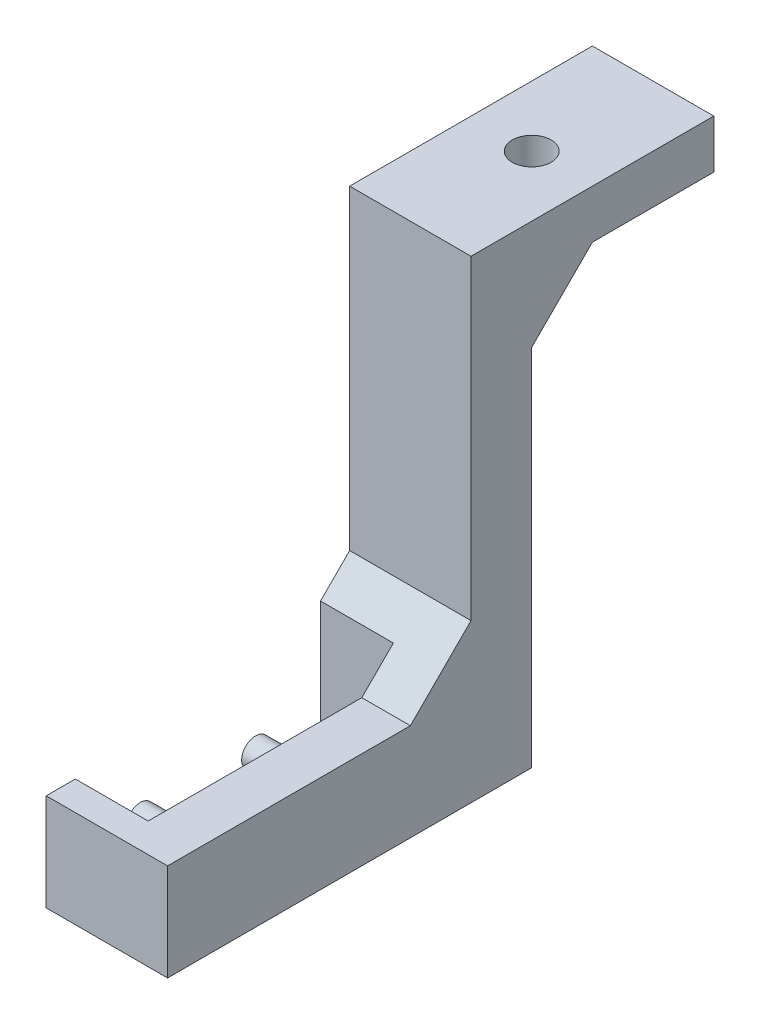
ISO-10303-21;
HEADER;
FILE_DESCRIPTION(('STEP AP214'),'2;1');
FILE_NAME('part.step','',(''),(''),'','','');
FILE_SCHEMA(('AUTOMOTIVE_DESIGN { 1 0 10303 214 1 1 1 1 }'));
ENDSEC;
DATA;
#1=APPLICATION_CONTEXT('core data for automotive mechanical design processes');
#2=APPLICATION_PROTOCOL_DEFINITION('international standard','automotive_design',2000,#1);
#3=PRODUCT_CONTEXT('',#1,'mechanical');
#4=PRODUCT('Part','Part','',(#3));
#5=PRODUCT_RELATED_PRODUCT_CATEGORY('part','',(#4));
#6=PRODUCT_DEFINITION_FORMATION('','',#4);
#7=PRODUCT_DEFINITION_CONTEXT('part definition',#1,'design');
#8=PRODUCT_DEFINITION('design','',#6,#7);
#9=PRODUCT_DEFINITION_SHAPE('','',#8);
#10=(LENGTH_UNIT() NAMED_UNIT(*) SI_UNIT(.MILLI.,.METRE.));
#11=(NAMED_UNIT(*) PLANE_ANGLE_UNIT() SI_UNIT($,.RADIAN.));
#12=(NAMED_UNIT(*) SI_UNIT($,.STERADIAN.) SOLID_ANGLE_UNIT());
#13=UNCERTAINTY_MEASURE_WITH_UNIT(LENGTH_MEASURE(1.E-05),#10,'distance_accuracy_value','');
#14=(GEOMETRIC_REPRESENTATION_CONTEXT(3) GLOBAL_UNCERTAINTY_ASSIGNED_CONTEXT((#13)) GLOBAL_UNIT_ASSIGNED_CONTEXT((#10,
#11,#12)) REPRESENTATION_CONTEXT('',''));
#15=CARTESIAN_POINT('',(0.,0.,0.));
#16=DIRECTION('',(0.,0.,1.));
#17=DIRECTION('',(1.,0.,0.));
#18=AXIS2_PLACEMENT_3D('',#15,#16,#17);
#19=CARTESIAN_POINT('',(5.,35.,-35.));
#20=DIRECTION('',(0.,-0.707106781186551,-0.707106781186544));
#21=DIRECTION('',(1.,0.,0.));
#22=AXIS2_PLACEMENT_3D('',#19,#20,#21);
#23=PLANE('',#22);
#24=CARTESIAN_POINT('',(0.,35.,-35.));
#25=DIRECTION('',(0.,-0.707106781186551,-0.707106781186544));
#26=DIRECTION('',(0.,0.707106781186544,-0.707106781186551));
#27=AXIS2_PLACEMENT_3D('',#24,#25,#26);
#28=ELLIPSE('',#27,4.24264068711927,3.);
#29=CARTESIAN_POINT('',(3.,35.,-35.));
#30=VERTEX_POINT('',#29);
#31=CARTESIAN_POINT('',(-3.,35.,-35.));
#32=VERTEX_POINT('',#31);
#33=EDGE_CURVE('E11',#30,#32,#28,.T.);
#34=ORIENTED_EDGE('',*,*,#33,.F.);
#35=DIRECTION('',(-1.,0.,0.));
#36=VECTOR('',#35,1.);
#37=CARTESIAN_POINT('',(-5.,35.,-35.));
#38=LINE('',#37,#36);
#39=CARTESIAN_POINT('',(5.,35.,-35.));
#40=VERTEX_POINT('',#39);
#41=EDGE_CURVE('E157',#40,#30,#38,.T.);
#42=ORIENTED_EDGE('',*,*,#41,.F.);
#43=DIRECTION('',(0.,-0.707106781186544,0.707106781186551));
#44=VECTOR('',#43,1.);
#45=CARTESIAN_POINT('',(5.,35.,-35.));
#46=LINE('',#45,#44);
#47=CARTESIAN_POINT('',(5.,30.,-30.));
#48=VERTEX_POINT('',#47);
#49=EDGE_CURVE('E184',#48,#40,#46,.F.);
#50=ORIENTED_EDGE('',*,*,#49,.F.);
#51=DIRECTION('',(1.,0.,0.));
#52=VECTOR('',#51,1.);
#53=CARTESIAN_POINT('',(5.,30.,-30.));
#54=LINE('',#53,#52);
#55=CARTESIAN_POINT('',(-5.,30.,-30.));
#56=VERTEX_POINT('',#55);
#57=EDGE_CURVE('E165',#56,#48,#54,.T.);
#58=ORIENTED_EDGE('',*,*,#57,.F.);
#59=DIRECTION('',(0.,0.707106781186544,-0.707106781186551));
#60=VECTOR('',#59,1.);
#61=CARTESIAN_POINT('',(-5.,0.,0.));
#62=LINE('',#61,#60);
#63=CARTESIAN_POINT('',(-5.,35.,-35.));
#64=VERTEX_POINT('',#63);
#65=EDGE_CURVE('E181',#64,#56,#62,.F.);
#66=ORIENTED_EDGE('',*,*,#65,.F.);
#67=EDGE_CURVE('E159',#32,#64,#38,.T.);
#68=ORIENTED_EDGE('',*,*,#67,.F.);
#69=EDGE_LOOP('',(#34,#42,#50,#58,#66,#68));
#70=FACE_BOUND('',#69,.T.);
#71=ADVANCED_FACE('F41',(#70),#23,.T.);
#72=CARTESIAN_POINT('',(-5.,0.,0.));
#73=DIRECTION('',(1.,0.,0.));
#74=DIRECTION('',(0.,0.,-1.));
#75=AXIS2_PLACEMENT_3D('',#72,#73,#74);
#76=PLANE('',#75);
#77=DIRECTION('',(0.,0.,-1.));
#78=VECTOR('',#77,1.);
#79=CARTESIAN_POINT('',(-5.,0.,0.));
#80=LINE('',#79,#78);
#81=CARTESIAN_POINT('',(-5.,0.,-22.6));
#82=VERTEX_POINT('',#81);
#83=CARTESIAN_POINT('',(-5.,0.,-30.));
#84=VERTEX_POINT('',#83);
#85=EDGE_CURVE('E279',#82,#84,#80,.T.);
#86=ORIENTED_EDGE('',*,*,#85,.F.);
#87=DIRECTION('',(0.,-1.,0.));
#88=VECTOR('',#87,1.);
#89=CARTESIAN_POINT('',(-5.,8.,-22.6));
#90=LINE('',#89,#88);
#91=CARTESIAN_POINT('',(-5.,10.6000000000001,-22.6));
#92=VERTEX_POINT('',#91);
#93=EDGE_CURVE('E65',#92,#82,#90,.T.);
#94=ORIENTED_EDGE('',*,*,#93,.F.);
#95=DIRECTION('',(0.,-0.707106781186544,0.707106781186551));
#96=VECTOR('',#95,1.);
#97=CARTESIAN_POINT('',(-5.,-5.99999999999992,-5.99999999999986));
#98=LINE('',#97,#96);
#99=CARTESIAN_POINT('',(-5.,13.,-25.));
#100=VERTEX_POINT('',#99);
#101=EDGE_CURVE('E194',#92,#100,#98,.F.);
#102=ORIENTED_EDGE('',*,*,#101,.T.);
#103=DIRECTION('',(0.,-1.,0.));
#104=VECTOR('',#103,1.);
#105=CARTESIAN_POINT('',(-5.,39.,-25.));
#106=LINE('',#105,#104);
#107=CARTESIAN_POINT('',(-5.,39.,-25.));
#108=VERTEX_POINT('',#107);
#109=EDGE_CURVE('E297',#108,#100,#106,.T.);
#110=ORIENTED_EDGE('',*,*,#109,.F.);
#111=DIRECTION('',(0.,0.,1.));
#112=VECTOR('',#111,1.);
#113=CARTESIAN_POINT('',(-5.,39.,-45.));
#114=LINE('',#113,#112);
#115=CARTESIAN_POINT('',(-5.,39.,-45.));
#116=VERTEX_POINT('',#115);
#117=EDGE_CURVE('E294',#116,#108,#114,.T.);
#118=ORIENTED_EDGE('',*,*,#117,.F.);
#119=DIRECTION('',(0.,1.,0.));
#120=VECTOR('',#119,1.);
#121=CARTESIAN_POINT('',(-5.,35.,-45.));
#122=LINE('',#121,#120);
#123=CARTESIAN_POINT('',(-5.,35.,-45.));
#124=VERTEX_POINT('',#123);
#125=EDGE_CURVE('E291',#124,#116,#122,.T.);
#126=ORIENTED_EDGE('',*,*,#125,.F.);
#127=DIRECTION('',(0.,0.,-1.));
#128=VECTOR('',#127,1.);
#129=CARTESIAN_POINT('',(-5.,35.,-30.));
#130=LINE('',#129,#128);
#131=EDGE_CURVE('E288',#64,#124,#130,.T.);
#132=ORIENTED_EDGE('',*,*,#131,.F.);
#133=ORIENTED_EDGE('',*,*,#65,.T.);
#134=DIRECTION('',(0.,1.,0.));
#135=VECTOR('',#134,1.);
#136=CARTESIAN_POINT('',(-5.,0.,-30.));
#137=LINE('',#136,#135);
#138=EDGE_CURVE('E284',#84,#56,#137,.T.);
#139=ORIENTED_EDGE('',*,*,#138,.F.);
#140=EDGE_LOOP('',(#86,#94,#102,#110,#118,#126,#132,#133,#139));
#141=FACE_BOUND('',#140,.T.);
#142=ADVANCED_FACE('F385',(#141),#76,.F.);
#143=CARTESIAN_POINT('',(5.,8.,0.));
#144=DIRECTION('',(0.,0.,-1.));
#145=DIRECTION('',(0.,1.,0.));
#146=AXIS2_PLACEMENT_3D('',#143,#144,#145);
#147=PLANE('',#146);
#148=DIRECTION('',(0.,-1.,0.));
#149=VECTOR('',#148,1.);
#150=CARTESIAN_POINT('',(-5.,8.,0.));
#151=LINE('',#150,#149);
#152=CARTESIAN_POINT('',(-5.,8.,0.));
#153=VERTEX_POINT('',#152);
#154=CARTESIAN_POINT('',(-5.,0.,0.));
#155=VERTEX_POINT('',#154);
#156=EDGE_CURVE('E252',#153,#155,#151,.T.);
#157=ORIENTED_EDGE('',*,*,#156,.T.);
#158=DIRECTION('',(-1.,0.,0.));
#159=VECTOR('',#158,1.);
#160=CARTESIAN_POINT('',(5.,0.,0.));
#161=LINE('',#160,#159);
#162=CARTESIAN_POINT('',(5.,0.,0.));
#163=VERTEX_POINT('',#162);
#164=EDGE_CURVE('E171',#163,#155,#161,.T.);
#165=ORIENTED_EDGE('',*,*,#164,.F.);
#166=DIRECTION('',(0.,-1.,0.));
#167=VECTOR('',#166,1.);
#168=CARTESIAN_POINT('',(5.,8.,0.));
#169=LINE('',#168,#167);
#170=CARTESIAN_POINT('',(5.,8.,0.));
#171=VERTEX_POINT('',#170);
#172=EDGE_CURVE('E255',#171,#163,#169,.T.);
#173=ORIENTED_EDGE('',*,*,#172,.F.);
#174=DIRECTION('',(-1.,0.,0.));
#175=VECTOR('',#174,1.);
#176=CARTESIAN_POINT('',(5.,8.,0.));
#177=LINE('',#176,#175);
#178=EDGE_CURVE('E215',#171,#153,#177,.T.);
#179=ORIENTED_EDGE('',*,*,#178,.T.);
#180=EDGE_LOOP('',(#157,#165,#173,#179));
#181=FACE_BOUND('',#180,.T.);
#182=ADVANCED_FACE('F331',(#181),#147,.F.);
#183=CARTESIAN_POINT('',(5.,0.,0.));
#184=DIRECTION('',(0.,1.,0.));
#185=DIRECTION('',(0.,0.,1.));
#186=AXIS2_PLACEMENT_3D('',#183,#184,#185);
#187=PLANE('',#186);
#188=DIRECTION('',(0.,0.,1.));
#189=VECTOR('',#188,1.);
#190=CARTESIAN_POINT('',(1.,0.,-22.6));
#191=LINE('',#190,#189);
#192=CARTESIAN_POINT('',(1.,0.,-22.6));
#193=VERTEX_POINT('',#192);
#194=CARTESIAN_POINT('',(1.,0.,-2.4));
#195=VERTEX_POINT('',#194);
#196=EDGE_CURVE('E239',#193,#195,#191,.T.);
#197=ORIENTED_EDGE('',*,*,#196,.F.);
#198=DIRECTION('',(-1.,0.,0.));
#199=VECTOR('',#198,1.);
#200=CARTESIAN_POINT('',(1.,0.,-22.6));
#201=LINE('',#200,#199);
#202=EDGE_CURVE('E232',#193,#82,#201,.T.);
#203=ORIENTED_EDGE('',*,*,#202,.T.);
#204=ORIENTED_EDGE('',*,*,#85,.T.);
#205=DIRECTION('',(-1.,0.,0.));
#206=VECTOR('',#205,1.);
#207=CARTESIAN_POINT('',(5.,0.,-30.));
#208=LINE('',#207,#206);
#209=CARTESIAN_POINT('',(5.,0.,-30.));
#210=VERTEX_POINT('',#209);
#211=EDGE_CURVE('E316',#210,#84,#208,.T.);
#212=ORIENTED_EDGE('',*,*,#211,.F.);
#213=DIRECTION('',(0.,0.,-1.));
#214=VECTOR('',#213,1.);
#215=CARTESIAN_POINT('',(5.,0.,0.));
#216=LINE('',#215,#214);
#217=EDGE_CURVE('E258',#163,#210,#216,.T.);
#218=ORIENTED_EDGE('',*,*,#217,.F.);
#219=ORIENTED_EDGE('',*,*,#164,.T.);
#220=CARTESIAN_POINT('',(-5.,0.,-2.4));
#221=VERTEX_POINT('',#220);
#222=EDGE_CURVE('E280',#155,#221,#80,.T.);
#223=ORIENTED_EDGE('',*,*,#222,.T.);
#224=DIRECTION('',(-1.,0.,0.));
#225=VECTOR('',#224,1.);
#226=CARTESIAN_POINT('',(1.,0.,-2.4));
#227=LINE('',#226,#225);
#228=EDGE_CURVE('E237',#195,#221,#227,.T.);
#229=ORIENTED_EDGE('',*,*,#228,.F.);
#230=EDGE_LOOP('',(#197,#203,#204,#212,#218,#219,#223,#229));
#231=FACE_BOUND('',#230,.T.);
#232=ADVANCED_FACE('F327',(#231),#187,.F.);
#233=CARTESIAN_POINT('',(5.,0.,-30.));
#234=DIRECTION('',(0.,0.,1.));
#235=DIRECTION('',(1.,0.,0.));
#236=AXIS2_PLACEMENT_3D('',#233,#234,#235);
#237=PLANE('',#236);
#238=ORIENTED_EDGE('',*,*,#138,.T.);
#239=ORIENTED_EDGE('',*,*,#57,.T.);
#240=DIRECTION('',(0.,1.,0.));
#241=VECTOR('',#240,1.);
#242=CARTESIAN_POINT('',(5.,0.,-30.));
#243=LINE('',#242,#241);
#244=EDGE_CURVE('E262',#210,#48,#243,.T.);
#245=ORIENTED_EDGE('',*,*,#244,.F.);
#246=ORIENTED_EDGE('',*,*,#211,.T.);
#247=EDGE_LOOP('',(#238,#239,#245,#246));
#248=FACE_BOUND('',#247,.T.);
#249=ADVANCED_FACE('F375',(#248),#237,.F.);
#250=CARTESIAN_POINT('',(5.,35.,-30.));
#251=DIRECTION('',(0.,1.,0.));
#252=DIRECTION('',(0.,0.,1.));
#253=AXIS2_PLACEMENT_3D('',#250,#251,#252);
#254=PLANE('',#253);
#255=CARTESIAN_POINT('',(0.,35.,-35.));
#256=DIRECTION('',(0.,-1.,0.));
#257=DIRECTION('',(0.,0.,-1.));
#258=AXIS2_PLACEMENT_3D('',#255,#256,#257);
#259=CIRCLE('',#258,1.6);
#260=CARTESIAN_POINT('',(0.,35.,-36.6));
#261=VERTEX_POINT('',#260);
#262=EDGE_CURVE('E356',#261,#261,#259,.T.);
#263=ORIENTED_EDGE('',*,*,#262,.F.);
#264=EDGE_LOOP('',(#263));
#265=FACE_BOUND('',#264,.T.);
#266=ORIENTED_EDGE('',*,*,#41,.T.);
#267=CARTESIAN_POINT('',(0.,35.,-35.));
#268=DIRECTION('',(0.,-1.,0.));
#269=DIRECTION('',(0.,0.,-1.));
#270=AXIS2_PLACEMENT_3D('',#267,#268,#269);
#271=CIRCLE('',#270,3.);
#272=EDGE_CURVE('E58',#30,#32,#271,.T.);
#273=ORIENTED_EDGE('',*,*,#272,.T.);
#274=ORIENTED_EDGE('',*,*,#67,.T.);
#275=ORIENTED_EDGE('',*,*,#131,.T.);
#276=DIRECTION('',(-1.,0.,0.));
#277=VECTOR('',#276,1.);
#278=CARTESIAN_POINT('',(5.,35.,-45.));
#279=LINE('',#278,#277);
#280=CARTESIAN_POINT('',(5.,35.,-45.));
#281=VERTEX_POINT('',#280);
#282=EDGE_CURVE('E313',#281,#124,#279,.T.);
#283=ORIENTED_EDGE('',*,*,#282,.F.);
#284=DIRECTION('',(0.,0.,-1.));
#285=VECTOR('',#284,1.);
#286=CARTESIAN_POINT('',(5.,35.,-30.));
#287=LINE('',#286,#285);
#288=EDGE_CURVE('E163',#40,#281,#287,.T.);
#289=ORIENTED_EDGE('',*,*,#288,.F.);
#290=EDGE_LOOP('',(#266,#273,#274,#275,#283,#289));
#291=FACE_BOUND('',#290,.T.);
#292=ADVANCED_FACE('F161',(#265,#291),#254,.F.);
#293=CARTESIAN_POINT('',(5.,35.,-45.));
#294=DIRECTION('',(0.,0.,1.));
#295=DIRECTION('',(1.,0.,0.));
#296=AXIS2_PLACEMENT_3D('',#293,#294,#295);
#297=PLANE('',#296);
#298=ORIENTED_EDGE('',*,*,#125,.T.);
#299=DIRECTION('',(-1.,0.,0.));
#300=VECTOR('',#299,1.);
#301=CARTESIAN_POINT('',(5.,39.,-45.));
#302=LINE('',#301,#300);
#303=CARTESIAN_POINT('',(5.,39.,-45.));
#304=VERTEX_POINT('',#303);
#305=EDGE_CURVE('E309',#304,#116,#302,.T.);
#306=ORIENTED_EDGE('',*,*,#305,.F.);
#307=DIRECTION('',(0.,1.,0.));
#308=VECTOR('',#307,1.);
#309=CARTESIAN_POINT('',(5.,35.,-45.));
#310=LINE('',#309,#308);
#311=EDGE_CURVE('E268',#281,#304,#310,.T.);
#312=ORIENTED_EDGE('',*,*,#311,.F.);
#313=ORIENTED_EDGE('',*,*,#282,.T.);
#314=EDGE_LOOP('',(#298,#306,#312,#313));
#315=FACE_BOUND('',#314,.T.);
#316=ADVANCED_FACE('F374',(#315),#297,.F.);
#317=CARTESIAN_POINT('',(5.,39.,-45.));
#318=DIRECTION('',(0.,-1.,0.));
#319=DIRECTION('',(0.,0.,-1.));
#320=AXIS2_PLACEMENT_3D('',#317,#318,#319);
#321=PLANE('',#320);
#322=CARTESIAN_POINT('',(0.,39.,-35.));
#323=DIRECTION('',(0.,-1.,0.));
#324=DIRECTION('',(0.,0.,-1.));
#325=AXIS2_PLACEMENT_3D('',#322,#323,#324);
#326=CIRCLE('',#325,1.6);
#327=CARTESIAN_POINT('',(0.,39.,-36.6));
#328=VERTEX_POINT('',#327);
#329=EDGE_CURVE('E152',#328,#328,#326,.T.);
#330=ORIENTED_EDGE('',*,*,#329,.T.);
#331=EDGE_LOOP('',(#330));
#332=FACE_BOUND('',#331,.T.);
#333=ORIENTED_EDGE('',*,*,#117,.T.);
#334=DIRECTION('',(-1.,0.,0.));
#335=VECTOR('',#334,1.);
#336=CARTESIAN_POINT('',(5.,39.,-25.));
#337=LINE('',#336,#335);
#338=CARTESIAN_POINT('',(5.,39.,-25.));
#339=VERTEX_POINT('',#338);
#340=EDGE_CURVE('E305',#339,#108,#337,.T.);
#341=ORIENTED_EDGE('',*,*,#340,.F.);
#342=DIRECTION('',(0.,0.,1.));
#343=VECTOR('',#342,1.);
#344=CARTESIAN_POINT('',(5.,39.,-45.));
#345=LINE('',#344,#343);
#346=EDGE_CURVE('E271',#304,#339,#345,.T.);
#347=ORIENTED_EDGE('',*,*,#346,.F.);
#348=ORIENTED_EDGE('',*,*,#305,.T.);
#349=EDGE_LOOP('',(#333,#341,#347,#348));
#350=FACE_BOUND('',#349,.T.);
#351=ADVANCED_FACE('F364',(#332,#350),#321,.F.);
#352=CARTESIAN_POINT('',(5.,39.,-25.));
#353=DIRECTION('',(0.,0.,-1.));
#354=DIRECTION('',(-1.,0.,0.));
#355=AXIS2_PLACEMENT_3D('',#352,#353,#354);
#356=PLANE('',#355);
#357=ORIENTED_EDGE('',*,*,#109,.T.);
#358=DIRECTION('',(1.,0.,0.));
#359=VECTOR('',#358,1.);
#360=CARTESIAN_POINT('',(5.,13.,-25.));
#361=LINE('',#360,#359);
#362=CARTESIAN_POINT('',(5.,13.,-25.));
#363=VERTEX_POINT('',#362);
#364=EDGE_CURVE('E178',#100,#363,#361,.T.);
#365=ORIENTED_EDGE('',*,*,#364,.T.);
#366=DIRECTION('',(0.,-1.,0.));
#367=VECTOR('',#366,1.);
#368=CARTESIAN_POINT('',(5.,39.,-25.));
#369=LINE('',#368,#367);
#370=EDGE_CURVE('E206',#339,#363,#369,.T.);
#371=ORIENTED_EDGE('',*,*,#370,.F.);
#372=ORIENTED_EDGE('',*,*,#340,.T.);
#373=EDGE_LOOP('',(#357,#365,#371,#372));
#374=FACE_BOUND('',#373,.T.);
#375=ADVANCED_FACE('F417',(#374),#356,.F.);
#376=CARTESIAN_POINT('',(5.,8.,-25.));
#377=DIRECTION('',(0.,-1.,0.));
#378=DIRECTION('',(0.,0.,-1.));
#379=AXIS2_PLACEMENT_3D('',#376,#377,#378);
#380=PLANE('',#379);
#381=DIRECTION('',(0.,0.,1.));
#382=VECTOR('',#381,1.);
#383=CARTESIAN_POINT('',(5.,8.,-25.));
#384=LINE('',#383,#382);
#385=CARTESIAN_POINT('',(5.,8.,-19.9999999999999));
#386=VERTEX_POINT('',#385);
#387=EDGE_CURVE('E203',#386,#171,#384,.T.);
#388=ORIENTED_EDGE('',*,*,#387,.F.);
#389=DIRECTION('',(-1.,0.,0.));
#390=VECTOR('',#389,1.);
#391=CARTESIAN_POINT('',(-5.,8.,-19.9999999999999));
#392=LINE('',#391,#390);
#393=CARTESIAN_POINT('',(1.,8.,-19.9999999999999));
#394=VERTEX_POINT('',#393);
#395=EDGE_CURVE('E169',#386,#394,#392,.T.);
#396=ORIENTED_EDGE('',*,*,#395,.T.);
#397=DIRECTION('',(0.,0.,-1.));
#398=VECTOR('',#397,1.);
#399=CARTESIAN_POINT('',(1.,8.,-22.6));
#400=LINE('',#399,#398);
#401=CARTESIAN_POINT('',(1.,8.,-2.4));
#402=VERTEX_POINT('',#401);
#403=EDGE_CURVE('E228',#402,#394,#400,.T.);
#404=ORIENTED_EDGE('',*,*,#403,.F.);
#405=DIRECTION('',(-1.,0.,0.));
#406=VECTOR('',#405,1.);
#407=CARTESIAN_POINT('',(1.,8.,-2.4));
#408=LINE('',#407,#406);
#409=CARTESIAN_POINT('',(-5.,8.,-2.4));
#410=VERTEX_POINT('',#409);
#411=EDGE_CURVE('E249',#402,#410,#408,.T.);
#412=ORIENTED_EDGE('',*,*,#411,.T.);
#413=DIRECTION('',(0.,0.,1.));
#414=VECTOR('',#413,1.);
#415=CARTESIAN_POINT('',(-5.,8.,-25.));
#416=LINE('',#415,#414);
#417=EDGE_CURVE('E259',#410,#153,#416,.T.);
#418=ORIENTED_EDGE('',*,*,#417,.T.);
#419=ORIENTED_EDGE('',*,*,#178,.F.);
#420=EDGE_LOOP('',(#388,#396,#404,#412,#418,#419));
#421=FACE_BOUND('',#420,.T.);
#422=ADVANCED_FACE('F211',(#421),#380,.F.);
#423=CARTESIAN_POINT('',(5.,0.,0.));
#424=DIRECTION('',(1.,0.,0.));
#425=DIRECTION('',(0.,0.,-1.));
#426=AXIS2_PLACEMENT_3D('',#423,#424,#425);
#427=PLANE('',#426);
#428=ORIENTED_EDGE('',*,*,#172,.T.);
#429=ORIENTED_EDGE('',*,*,#217,.T.);
#430=ORIENTED_EDGE('',*,*,#244,.T.);
#431=ORIENTED_EDGE('',*,*,#49,.T.);
#432=ORIENTED_EDGE('',*,*,#288,.T.);
#433=ORIENTED_EDGE('',*,*,#311,.T.);
#434=ORIENTED_EDGE('',*,*,#346,.T.);
#435=ORIENTED_EDGE('',*,*,#370,.T.);
#436=DIRECTION('',(0.,0.707106781186544,-0.707106781186551));
#437=VECTOR('',#436,1.);
#438=CARTESIAN_POINT('',(5.,8.,-19.9999999999999));
#439=LINE('',#438,#437);
#440=EDGE_CURVE('E51',#363,#386,#439,.F.);
#441=ORIENTED_EDGE('',*,*,#440,.T.);
#442=ORIENTED_EDGE('',*,*,#387,.T.);
#443=EDGE_LOOP('',(#428,#429,#430,#431,#432,#433,#434,#435,#441,#442));
#444=FACE_BOUND('',#443,.T.);
#445=ADVANCED_FACE('F202',(#444),#427,.T.);
#446=ORIENTED_EDGE('',*,*,#417,.F.);
#447=DIRECTION('',(0.,1.,0.));
#448=VECTOR('',#447,1.);
#449=CARTESIAN_POINT('',(-5.,8.,-2.4));
#450=LINE('',#449,#448);
#451=EDGE_CURVE('E245',#221,#410,#450,.T.);
#452=ORIENTED_EDGE('',*,*,#451,.F.);
#453=ORIENTED_EDGE('',*,*,#222,.F.);
#454=ORIENTED_EDGE('',*,*,#156,.F.);
#455=EDGE_LOOP('',(#446,#452,#453,#454));
#456=FACE_BOUND('',#455,.T.);
#457=ADVANCED_FACE('F334',(#456),#76,.F.);
#458=CARTESIAN_POINT('',(1.,8.,-22.6));
#459=DIRECTION('',(0.,0.,-1.));
#460=DIRECTION('',(-1.,0.,0.));
#461=AXIS2_PLACEMENT_3D('',#458,#459,#460);
#462=PLANE('',#461);
#463=ORIENTED_EDGE('',*,*,#93,.T.);
#464=ORIENTED_EDGE('',*,*,#202,.F.);
#465=DIRECTION('',(0.,-1.,0.));
#466=VECTOR('',#465,1.);
#467=CARTESIAN_POINT('',(1.,8.,-22.6));
#468=LINE('',#467,#466);
#469=CARTESIAN_POINT('',(1.,10.6000000000001,-22.6));
#470=VERTEX_POINT('',#469);
#471=EDGE_CURVE('E225',#470,#193,#468,.T.);
#472=ORIENTED_EDGE('',*,*,#471,.F.);
#473=DIRECTION('',(1.,0.,0.));
#474=VECTOR('',#473,1.);
#475=CARTESIAN_POINT('',(1.,10.6000000000001,-22.6));
#476=LINE('',#475,#474);
#477=EDGE_CURVE('E191',#470,#92,#476,.F.);
#478=ORIENTED_EDGE('',*,*,#477,.T.);
#479=EDGE_LOOP('',(#463,#464,#472,#478));
#480=FACE_BOUND('',#479,.T.);
#481=ADVANCED_FACE('F447',(#480),#462,.F.);
#482=CARTESIAN_POINT('',(1.,8.,-2.4));
#483=DIRECTION('',(0.,0.,1.));
#484=DIRECTION('',(0.,-1.,0.));
#485=AXIS2_PLACEMENT_3D('',#482,#483,#484);
#486=PLANE('',#485);
#487=ORIENTED_EDGE('',*,*,#451,.T.);
#488=ORIENTED_EDGE('',*,*,#411,.F.);
#489=DIRECTION('',(0.,1.,0.));
#490=VECTOR('',#489,1.);
#491=CARTESIAN_POINT('',(1.,8.,-2.4));
#492=LINE('',#491,#490);
#493=EDGE_CURVE('E229',#195,#402,#492,.T.);
#494=ORIENTED_EDGE('',*,*,#493,.F.);
#495=ORIENTED_EDGE('',*,*,#228,.T.);
#496=EDGE_LOOP('',(#487,#488,#494,#495));
#497=FACE_BOUND('',#496,.T.);
#498=ADVANCED_FACE('F337',(#497),#486,.F.);
#499=CARTESIAN_POINT('',(1.,0.,0.));
#500=DIRECTION('',(-1.,0.,0.));
#501=DIRECTION('',(0.,0.,1.));
#502=AXIS2_PLACEMENT_3D('',#499,#500,#501);
#503=PLANE('',#502);
#504=CARTESIAN_POINT('',(1.,2.5,-7.75));
#505=DIRECTION('',(-1.,0.,0.));
#506=DIRECTION('',(0.,0.,1.));
#507=AXIS2_PLACEMENT_3D('',#504,#505,#506);
#508=CIRCLE('',#507,1.15);
#509=CARTESIAN_POINT('',(1.,2.5,-6.6));
#510=VERTEX_POINT('',#509);
#511=EDGE_CURVE('E151',#510,#510,#508,.T.);
#512=ORIENTED_EDGE('',*,*,#511,.F.);
#513=EDGE_LOOP('',(#512));
#514=FACE_BOUND('',#513,.T.);
#515=CARTESIAN_POINT('',(1.,2.5,-17.25));
#516=DIRECTION('',(-1.,0.,0.));
#517=DIRECTION('',(0.,0.,1.));
#518=AXIS2_PLACEMENT_3D('',#515,#516,#517);
#519=CIRCLE('',#518,1.15);
#520=CARTESIAN_POINT('',(1.,2.5,-16.1));
#521=VERTEX_POINT('',#520);
#522=EDGE_CURVE('E342',#521,#521,#519,.T.);
#523=ORIENTED_EDGE('',*,*,#522,.F.);
#524=EDGE_LOOP('',(#523));
#525=FACE_BOUND('',#524,.T.);
#526=ORIENTED_EDGE('',*,*,#471,.T.);
#527=ORIENTED_EDGE('',*,*,#196,.T.);
#528=ORIENTED_EDGE('',*,*,#493,.T.);
#529=ORIENTED_EDGE('',*,*,#403,.T.);
#530=DIRECTION('',(0.,-0.707106781186544,0.707106781186551));
#531=VECTOR('',#530,1.);
#532=CARTESIAN_POINT('',(1.,8.,-19.9999999999999));
#533=LINE('',#532,#531);
#534=EDGE_CURVE('E187',#394,#470,#533,.F.);
#535=ORIENTED_EDGE('',*,*,#534,.T.);
#536=EDGE_LOOP('',(#526,#527,#528,#529,#535));
#537=FACE_BOUND('',#536,.T.);
#538=ADVANCED_FACE('F223',(#514,#525,#537),#503,.T.);
#539=CARTESIAN_POINT('',(-5.,2.5,-17.25));
#540=DIRECTION('',(1.,0.,0.));
#541=DIRECTION('',(0.,0.,-1.));
#542=AXIS2_PLACEMENT_3D('',#539,#540,#541);
#543=CYLINDRICAL_SURFACE('',#542,1.15);
#544=CARTESIAN_POINT('',(-5.,2.5,-17.25));
#545=DIRECTION('',(-1.,0.,0.));
#546=DIRECTION('',(0.,0.,1.));
#547=AXIS2_PLACEMENT_3D('',#544,#545,#546);
#548=CIRCLE('',#547,1.15);
#549=CARTESIAN_POINT('',(-5.,2.5,-16.1));
#550=VERTEX_POINT('',#549);
#551=EDGE_CURVE('E246',#550,#550,#548,.T.);
#552=ORIENTED_EDGE('',*,*,#551,.F.);
#553=EDGE_LOOP('',(#552));
#554=FACE_BOUND('',#553,.T.);
#555=ORIENTED_EDGE('',*,*,#522,.T.);
#556=EDGE_LOOP('',(#555));
#557=FACE_BOUND('',#556,.T.);
#558=ADVANCED_FACE('F463',(#554,#557),#543,.T.);
#559=CARTESIAN_POINT('',(-5.,2.5,-17.25));
#560=DIRECTION('',(-1.,0.,0.));
#561=DIRECTION('',(0.,0.,1.));
#562=AXIS2_PLACEMENT_3D('',#559,#560,#561);
#563=PLANE('',#562);
#564=ORIENTED_EDGE('',*,*,#551,.T.);
#565=EDGE_LOOP('',(#564));
#566=FACE_BOUND('',#565,.T.);
#567=ADVANCED_FACE('F524',(#566),#563,.T.);
#568=CARTESIAN_POINT('',(-5.,2.5,-7.75));
#569=DIRECTION('',(1.,0.,0.));
#570=DIRECTION('',(0.,0.,-1.));
#571=AXIS2_PLACEMENT_3D('',#568,#569,#570);
#572=CYLINDRICAL_SURFACE('',#571,1.15);
#573=CARTESIAN_POINT('',(-5.,2.5,-7.75));
#574=DIRECTION('',(-1.,0.,0.));
#575=DIRECTION('',(0.,0.,1.));
#576=AXIS2_PLACEMENT_3D('',#573,#574,#575);
#577=CIRCLE('',#576,1.15);
#578=CARTESIAN_POINT('',(-5.,2.5,-6.6));
#579=VERTEX_POINT('',#578);
#580=EDGE_CURVE('E346',#579,#579,#577,.T.);
#581=ORIENTED_EDGE('',*,*,#580,.F.);
#582=EDGE_LOOP('',(#581));
#583=FACE_BOUND('',#582,.T.);
#584=ORIENTED_EDGE('',*,*,#511,.T.);
#585=EDGE_LOOP('',(#584));
#586=FACE_BOUND('',#585,.T.);
#587=ADVANCED_FACE('F528',(#583,#586),#572,.T.);
#588=CARTESIAN_POINT('',(-5.,2.5,-7.75));
#589=DIRECTION('',(-1.,0.,0.));
#590=DIRECTION('',(0.,0.,1.));
#591=AXIS2_PLACEMENT_3D('',#588,#589,#590);
#592=PLANE('',#591);
#593=ORIENTED_EDGE('',*,*,#580,.T.);
#594=EDGE_LOOP('',(#593));
#595=FACE_BOUND('',#594,.T.);
#596=ADVANCED_FACE('F474',(#595),#592,.T.);
#597=CARTESIAN_POINT('',(5.,8.,-19.9999999999999));
#598=DIRECTION('',(0.,0.707106781186551,0.707106781186544));
#599=DIRECTION('',(1.,0.,0.));
#600=AXIS2_PLACEMENT_3D('',#597,#598,#599);
#601=PLANE('',#600);
#602=ORIENTED_EDGE('',*,*,#440,.F.);
#603=ORIENTED_EDGE('',*,*,#364,.F.);
#604=ORIENTED_EDGE('',*,*,#101,.F.);
#605=ORIENTED_EDGE('',*,*,#477,.F.);
#606=ORIENTED_EDGE('',*,*,#534,.F.);
#607=ORIENTED_EDGE('',*,*,#395,.F.);
#608=EDGE_LOOP('',(#602,#603,#604,#605,#606,#607));
#609=FACE_BOUND('',#608,.T.);
#610=ADVANCED_FACE('F44',(#609),#601,.T.);
#611=CARTESIAN_POINT('',(0.,29.,-35.));
#612=DIRECTION('',(0.,1.,0.));
#613=DIRECTION('',(0.,0.,1.));
#614=AXIS2_PLACEMENT_3D('',#611,#612,#613);
#615=CYLINDRICAL_SURFACE('',#614,3.);
#616=ORIENTED_EDGE('',*,*,#33,.T.);
#617=ORIENTED_EDGE('',*,*,#272,.F.);
#618=EDGE_LOOP('',(#616,#617));
#619=FACE_BOUND('',#618,.T.);
#620=ADVANCED_FACE('F148',(#619),#615,.F.);
#621=CARTESIAN_POINT('',(0.,39.,-35.));
#622=DIRECTION('',(0.,-1.,0.));
#623=DIRECTION('',(0.,0.,-1.));
#624=AXIS2_PLACEMENT_3D('',#621,#622,#623);
#625=CYLINDRICAL_SURFACE('',#624,1.6);
#626=ORIENTED_EDGE('',*,*,#329,.F.);
#627=EDGE_LOOP('',(#626));
#628=FACE_BOUND('',#627,.T.);
#629=ORIENTED_EDGE('',*,*,#262,.T.);
#630=EDGE_LOOP('',(#629));
#631=FACE_BOUND('',#630,.T.);
#632=ADVANCED_FACE('F367',(#628,#631),#625,.F.);
#633=CLOSED_SHELL('',(#71,#142,#182,#232,#249,#292,#316,#351,#375,#422,#445,#457,#481,#498,#538,
#558,#567,#587,#596,#610,#620,#632));
#634=MANIFOLD_SOLID_BREP('B2',#633);
#635=ADVANCED_BREP_SHAPE_REPRESENTATION('',(#18,#634),#14);
#636=SHAPE_DEFINITION_REPRESENTATION(#9,#635);
ENDSEC;
END-ISO-10303-21;
